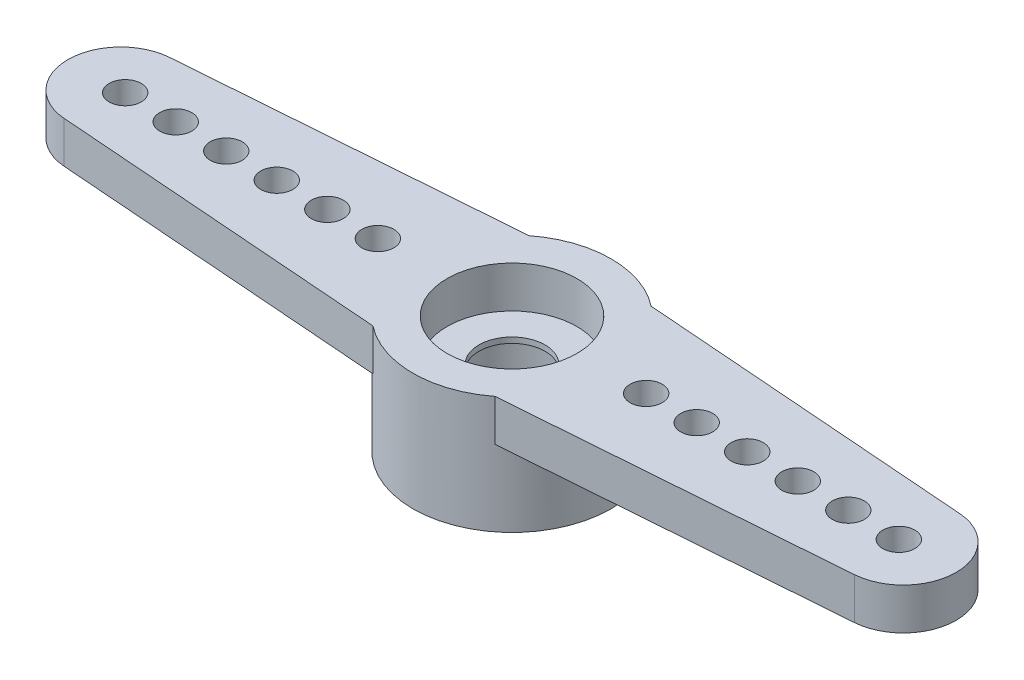
ISO-10303-21;
HEADER;
FILE_DESCRIPTION(('STEP AP214'),'2;1');
FILE_NAME('part.step','',(''),(''),'','','');
FILE_SCHEMA(('AUTOMOTIVE_DESIGN { 1 0 10303 214 1 1 1 1 }'));
ENDSEC;
DATA;
#1=APPLICATION_CONTEXT('core data for automotive mechanical design processes');
#2=APPLICATION_PROTOCOL_DEFINITION('international standard','automotive_design',2000,#1);
#3=PRODUCT_CONTEXT('',#1,'mechanical');
#4=PRODUCT('Part','Part','',(#3));
#5=PRODUCT_RELATED_PRODUCT_CATEGORY('part','',(#4));
#6=PRODUCT_DEFINITION_FORMATION('','',#4);
#7=PRODUCT_DEFINITION_CONTEXT('part definition',#1,'design');
#8=PRODUCT_DEFINITION('design','',#6,#7);
#9=PRODUCT_DEFINITION_SHAPE('','',#8);
#10=(LENGTH_UNIT() NAMED_UNIT(*) SI_UNIT(.MILLI.,.METRE.));
#11=(NAMED_UNIT(*) PLANE_ANGLE_UNIT() SI_UNIT($,.RADIAN.));
#12=(NAMED_UNIT(*) SI_UNIT($,.STERADIAN.) SOLID_ANGLE_UNIT());
#13=UNCERTAINTY_MEASURE_WITH_UNIT(LENGTH_MEASURE(1.E-05),#10,'distance_accuracy_value','');
#14=(GEOMETRIC_REPRESENTATION_CONTEXT(3) GLOBAL_UNCERTAINTY_ASSIGNED_CONTEXT((#13)) GLOBAL_UNIT_ASSIGNED_CONTEXT((#10,
#11,#12)) REPRESENTATION_CONTEXT('',''));
#15=CARTESIAN_POINT('',(0.,0.,0.));
#16=DIRECTION('',(0.,0.,1.));
#17=DIRECTION('',(1.,0.,0.));
#18=AXIS2_PLACEMENT_3D('',#15,#16,#17);
#19=CARTESIAN_POINT('',(-14.13,0.,0.));
#20=DIRECTION('',(0.,1.,0.));
#21=DIRECTION('',(0.,0.,1.));
#22=AXIS2_PLACEMENT_3D('',#19,#20,#21);
#23=PLANE('',#22);
#24=CARTESIAN_POINT('',(12.145,0.,0.));
#25=DIRECTION('',(0.,1.,0.));
#26=DIRECTION('',(0.,0.,1.));
#27=AXIS2_PLACEMENT_3D('',#24,#25,#26);
#28=CIRCLE('',#27,0.58);
#29=CARTESIAN_POINT('',(12.145,0.,0.58));
#30=VERTEX_POINT('',#29);
#31=EDGE_CURVE('E363',#30,#30,#28,.F.);
#32=ORIENTED_EDGE('',*,*,#31,.F.);
#33=EDGE_LOOP('',(#32));
#34=FACE_BOUND('',#33,.T.);
#35=CARTESIAN_POINT('',(8.495,0.,0.));
#36=DIRECTION('',(0.,1.,0.));
#37=DIRECTION('',(0.,0.,1.));
#38=AXIS2_PLACEMENT_3D('',#35,#36,#37);
#39=CIRCLE('',#38,0.58);
#40=CARTESIAN_POINT('',(8.495,0.,0.58));
#41=VERTEX_POINT('',#40);
#42=EDGE_CURVE('E378',#41,#41,#39,.F.);
#43=ORIENTED_EDGE('',*,*,#42,.F.);
#44=EDGE_LOOP('',(#43));
#45=FACE_BOUND('',#44,.T.);
#46=CARTESIAN_POINT('',(4.845,0.,0.));
#47=DIRECTION('',(0.,1.,0.));
#48=DIRECTION('',(0.,0.,1.));
#49=AXIS2_PLACEMENT_3D('',#46,#47,#48);
#50=CIRCLE('',#49,0.58);
#51=CARTESIAN_POINT('',(4.845,0.,0.58));
#52=VERTEX_POINT('',#51);
#53=EDGE_CURVE('E390',#52,#52,#50,.F.);
#54=ORIENTED_EDGE('',*,*,#53,.F.);
#55=EDGE_LOOP('',(#54));
#56=FACE_BOUND('',#55,.T.);
#57=CARTESIAN_POINT('',(0.,0.,0.));
#58=DIRECTION('',(0.,-1.,0.));
#59=DIRECTION('',(0.,0.,-1.));
#60=AXIS2_PLACEMENT_3D('',#57,#58,#59);
#61=CIRCLE('',#60,3.58);
#62=CARTESIAN_POINT('',(2.20544780033444,0.,-2.82));
#63=VERTEX_POINT('',#62);
#64=CARTESIAN_POINT('',(2.20544780033444,0.,2.82));
#65=VERTEX_POINT('',#64);
#66=EDGE_CURVE('E148',#63,#65,#61,.T.);
#67=ORIENTED_EDGE('',*,*,#66,.F.);
#68=DIRECTION('',(-0.997135515892556,0.,-0.0756357253266335));
#69=VECTOR('',#68,1.);
#70=CARTESIAN_POINT('',(14.2744642353739,0.,-1.90452883535478));
#71=LINE('',#70,#69);
#72=CARTESIAN_POINT('',(14.2744642353739,0.,-1.90452883535478));
#73=VERTEX_POINT('',#72);
#74=EDGE_CURVE('E116',#73,#63,#71,.T.);
#75=ORIENTED_EDGE('',*,*,#74,.F.);
#76=CARTESIAN_POINT('',(14.13,0.,0.));
#77=DIRECTION('',(0.,1.,0.));
#78=DIRECTION('',(0.,0.,1.));
#79=AXIS2_PLACEMENT_3D('',#76,#77,#78);
#80=CIRCLE('',#79,1.91);
#81=CARTESIAN_POINT('',(14.2744642353739,0.,1.90452883535478));
#82=VERTEX_POINT('',#81);
#83=EDGE_CURVE('E133',#82,#73,#80,.T.);
#84=ORIENTED_EDGE('',*,*,#83,.F.);
#85=DIRECTION('',(0.997135515892556,0.,-0.0756357253266335));
#86=VECTOR('',#85,1.);
#87=CARTESIAN_POINT('',(14.2744642353739,0.,1.90452883535478));
#88=LINE('',#87,#86);
#89=EDGE_CURVE('E135',#65,#82,#88,.T.);
#90=ORIENTED_EDGE('',*,*,#89,.F.);
#91=EDGE_LOOP('',(#67,#75,#84,#90));
#92=FACE_BOUND('',#91,.T.);
#93=CARTESIAN_POINT('',(6.67,0.,0.));
#94=DIRECTION('',(0.,1.,0.));
#95=DIRECTION('',(0.,0.,1.));
#96=AXIS2_PLACEMENT_3D('',#93,#94,#95);
#97=CIRCLE('',#96,0.58);
#98=CARTESIAN_POINT('',(6.67,0.,0.58));
#99=VERTEX_POINT('',#98);
#100=EDGE_CURVE('E384',#99,#99,#97,.F.);
#101=ORIENTED_EDGE('',*,*,#100,.F.);
#102=EDGE_LOOP('',(#101));
#103=FACE_BOUND('',#102,.T.);
#104=CARTESIAN_POINT('',(10.32,0.,0.));
#105=DIRECTION('',(0.,1.,0.));
#106=DIRECTION('',(0.,0.,1.));
#107=AXIS2_PLACEMENT_3D('',#104,#105,#106);
#108=CIRCLE('',#107,0.58);
#109=CARTESIAN_POINT('',(10.32,0.,0.58));
#110=VERTEX_POINT('',#109);
#111=EDGE_CURVE('E372',#110,#110,#108,.F.);
#112=ORIENTED_EDGE('',*,*,#111,.F.);
#113=EDGE_LOOP('',(#112));
#114=FACE_BOUND('',#113,.T.);
#115=CARTESIAN_POINT('',(13.97,0.,0.));
#116=DIRECTION('',(0.,1.,0.));
#117=DIRECTION('',(0.,0.,1.));
#118=AXIS2_PLACEMENT_3D('',#115,#116,#117);
#119=CIRCLE('',#118,0.58);
#120=CARTESIAN_POINT('',(13.97,0.,0.58));
#121=VERTEX_POINT('',#120);
#122=EDGE_CURVE('E358',#121,#121,#119,.F.);
#123=ORIENTED_EDGE('',*,*,#122,.F.);
#124=EDGE_LOOP('',(#123));
#125=FACE_BOUND('',#124,.T.);
#126=ADVANCED_FACE('F30',(#34,#45,#56,#92,#103,#114,#125),#23,.F.);
#127=CARTESIAN_POINT('',(-14.13,1.5,0.));
#128=DIRECTION('',(0.,1.,0.));
#129=DIRECTION('',(0.,0.,1.));
#130=AXIS2_PLACEMENT_3D('',#127,#128,#129);
#131=PLANE('',#130);
#132=CARTESIAN_POINT('',(12.145,1.5,0.));
#133=DIRECTION('',(0.,-1.,0.));
#134=DIRECTION('',(0.,0.,1.));
#135=AXIS2_PLACEMENT_3D('',#132,#133,#134);
#136=CIRCLE('',#135,0.58);
#137=CARTESIAN_POINT('',(12.145,1.5,0.58));
#138=VERTEX_POINT('',#137);
#139=EDGE_CURVE('E360',#138,#138,#136,.T.);
#140=ORIENTED_EDGE('',*,*,#139,.T.);
#141=EDGE_LOOP('',(#140));
#142=FACE_BOUND('',#141,.T.);
#143=CARTESIAN_POINT('',(8.495,1.5,0.));
#144=DIRECTION('',(0.,-1.,0.));
#145=DIRECTION('',(0.,0.,1.));
#146=AXIS2_PLACEMENT_3D('',#143,#144,#145);
#147=CIRCLE('',#146,0.58);
#148=CARTESIAN_POINT('',(8.495,1.5,0.58));
#149=VERTEX_POINT('',#148);
#150=EDGE_CURVE('E375',#149,#149,#147,.T.);
#151=ORIENTED_EDGE('',*,*,#150,.T.);
#152=EDGE_LOOP('',(#151));
#153=FACE_BOUND('',#152,.T.);
#154=CARTESIAN_POINT('',(4.845,1.5,0.));
#155=DIRECTION('',(0.,-1.,0.));
#156=DIRECTION('',(0.,0.,1.));
#157=AXIS2_PLACEMENT_3D('',#154,#155,#156);
#158=CIRCLE('',#157,0.58);
#159=CARTESIAN_POINT('',(4.845,1.5,0.58));
#160=VERTEX_POINT('',#159);
#161=EDGE_CURVE('E387',#160,#160,#158,.T.);
#162=ORIENTED_EDGE('',*,*,#161,.T.);
#163=EDGE_LOOP('',(#162));
#164=FACE_BOUND('',#163,.T.);
#165=CARTESIAN_POINT('',(-13.97,1.5,0.));
#166=DIRECTION('',(0.,1.,0.));
#167=DIRECTION('',(0.,0.,1.));
#168=AXIS2_PLACEMENT_3D('',#165,#166,#167);
#169=CIRCLE('',#168,0.58);
#170=CARTESIAN_POINT('',(-13.97,1.5,0.58));
#171=VERTEX_POINT('',#170);
#172=EDGE_CURVE('E393',#171,#171,#169,.T.);
#173=ORIENTED_EDGE('',*,*,#172,.F.);
#174=EDGE_LOOP('',(#173));
#175=FACE_BOUND('',#174,.T.);
#176=CARTESIAN_POINT('',(-12.145,1.5,0.));
#177=DIRECTION('',(0.,1.,0.));
#178=DIRECTION('',(0.,0.,1.));
#179=AXIS2_PLACEMENT_3D('',#176,#177,#178);
#180=CIRCLE('',#179,0.58);
#181=CARTESIAN_POINT('',(-12.145,1.5,0.58));
#182=VERTEX_POINT('',#181);
#183=EDGE_CURVE('E397',#182,#182,#180,.T.);
#184=ORIENTED_EDGE('',*,*,#183,.F.);
#185=EDGE_LOOP('',(#184));
#186=FACE_BOUND('',#185,.T.);
#187=CARTESIAN_POINT('',(-10.32,1.5,0.));
#188=DIRECTION('',(0.,1.,0.));
#189=DIRECTION('',(0.,0.,1.));
#190=AXIS2_PLACEMENT_3D('',#187,#188,#189);
#191=CIRCLE('',#190,0.58);
#192=CARTESIAN_POINT('',(-10.32,1.5,0.58));
#193=VERTEX_POINT('',#192);
#194=EDGE_CURVE('E401',#193,#193,#191,.T.);
#195=ORIENTED_EDGE('',*,*,#194,.F.);
#196=EDGE_LOOP('',(#195));
#197=FACE_BOUND('',#196,.T.);
#198=CARTESIAN_POINT('',(-8.495,1.5,0.));
#199=DIRECTION('',(0.,1.,0.));
#200=DIRECTION('',(0.,0.,1.));
#201=AXIS2_PLACEMENT_3D('',#198,#199,#200);
#202=CIRCLE('',#201,0.58);
#203=CARTESIAN_POINT('',(-8.495,1.5,0.58));
#204=VERTEX_POINT('',#203);
#205=EDGE_CURVE('E405',#204,#204,#202,.T.);
#206=ORIENTED_EDGE('',*,*,#205,.F.);
#207=EDGE_LOOP('',(#206));
#208=FACE_BOUND('',#207,.T.);
#209=CARTESIAN_POINT('',(-6.67,1.5,0.));
#210=DIRECTION('',(0.,1.,0.));
#211=DIRECTION('',(0.,0.,1.));
#212=AXIS2_PLACEMENT_3D('',#209,#210,#211);
#213=CIRCLE('',#212,0.58);
#214=CARTESIAN_POINT('',(-6.67,1.5,0.58));
#215=VERTEX_POINT('',#214);
#216=EDGE_CURVE('E409',#215,#215,#213,.T.);
#217=ORIENTED_EDGE('',*,*,#216,.F.);
#218=EDGE_LOOP('',(#217));
#219=FACE_BOUND('',#218,.T.);
#220=CARTESIAN_POINT('',(-4.845,1.5,0.));
#221=DIRECTION('',(0.,1.,0.));
#222=DIRECTION('',(0.,0.,1.));
#223=AXIS2_PLACEMENT_3D('',#220,#221,#222);
#224=CIRCLE('',#223,0.58);
#225=CARTESIAN_POINT('',(-4.845,1.5,0.58));
#226=VERTEX_POINT('',#225);
#227=EDGE_CURVE('E265',#226,#226,#224,.T.);
#228=ORIENTED_EDGE('',*,*,#227,.F.);
#229=EDGE_LOOP('',(#228));
#230=FACE_BOUND('',#229,.T.);
#231=CARTESIAN_POINT('',(-14.13,1.5,0.));
#232=DIRECTION('',(0.,1.,0.));
#233=DIRECTION('',(0.,0.,1.));
#234=AXIS2_PLACEMENT_3D('',#231,#232,#233);
#235=CIRCLE('',#234,1.91);
#236=CARTESIAN_POINT('',(-14.2744642353739,1.5,-1.90452883535478));
#237=VERTEX_POINT('',#236);
#238=CARTESIAN_POINT('',(-14.2744642353739,1.5,1.90452883535478));
#239=VERTEX_POINT('',#238);
#240=EDGE_CURVE('E159',#237,#239,#235,.T.);
#241=ORIENTED_EDGE('',*,*,#240,.T.);
#242=DIRECTION('',(0.997135515892556,0.,0.0756357253266335));
#243=VECTOR('',#242,1.);
#244=CARTESIAN_POINT('',(-14.2744642353739,1.5,1.90452883535478));
#245=LINE('',#244,#243);
#246=CARTESIAN_POINT('',(-2.20544780033444,1.5,2.82));
#247=VERTEX_POINT('',#246);
#248=EDGE_CURVE('E83',#239,#247,#245,.T.);
#249=ORIENTED_EDGE('',*,*,#248,.T.);
#250=CARTESIAN_POINT('',(0.,1.5,0.));
#251=DIRECTION('',(0.,1.,0.));
#252=DIRECTION('',(0.,0.,1.));
#253=AXIS2_PLACEMENT_3D('',#250,#251,#252);
#254=CIRCLE('',#253,3.58);
#255=CARTESIAN_POINT('',(2.20544780033444,1.5,2.82));
#256=VERTEX_POINT('',#255);
#257=EDGE_CURVE('E162',#247,#256,#254,.T.);
#258=ORIENTED_EDGE('',*,*,#257,.T.);
#259=DIRECTION('',(0.997135515892556,0.,-0.0756357253266335));
#260=VECTOR('',#259,1.);
#261=CARTESIAN_POINT('',(14.2744642353739,1.5,1.90452883535478));
#262=LINE('',#261,#260);
#263=CARTESIAN_POINT('',(14.2744642353739,1.5,1.90452883535478));
#264=VERTEX_POINT('',#263);
#265=EDGE_CURVE('E164',#256,#264,#262,.T.);
#266=ORIENTED_EDGE('',*,*,#265,.T.);
#267=CARTESIAN_POINT('',(14.13,1.5,0.));
#268=DIRECTION('',(0.,1.,0.));
#269=DIRECTION('',(0.,0.,1.));
#270=AXIS2_PLACEMENT_3D('',#267,#268,#269);
#271=CIRCLE('',#270,1.91);
#272=CARTESIAN_POINT('',(14.2744642353739,1.5,-1.90452883535478));
#273=VERTEX_POINT('',#272);
#274=EDGE_CURVE('E105',#264,#273,#271,.T.);
#275=ORIENTED_EDGE('',*,*,#274,.T.);
#276=DIRECTION('',(-0.997135515892556,0.,-0.0756357253266335));
#277=VECTOR('',#276,1.);
#278=CARTESIAN_POINT('',(14.2744642353739,1.5,-1.90452883535478));
#279=LINE('',#278,#277);
#280=CARTESIAN_POINT('',(2.20544780033444,1.5,-2.82));
#281=VERTEX_POINT('',#280);
#282=EDGE_CURVE('E98',#273,#281,#279,.T.);
#283=ORIENTED_EDGE('',*,*,#282,.T.);
#284=CARTESIAN_POINT('',(0.,1.5,0.));
#285=DIRECTION('',(0.,1.,0.));
#286=DIRECTION('',(0.,0.,1.));
#287=AXIS2_PLACEMENT_3D('',#284,#285,#286);
#288=CIRCLE('',#287,3.58);
#289=CARTESIAN_POINT('',(-2.20544780033444,1.5,-2.82));
#290=VERTEX_POINT('',#289);
#291=EDGE_CURVE('E103',#281,#290,#288,.T.);
#292=ORIENTED_EDGE('',*,*,#291,.T.);
#293=DIRECTION('',(-0.997135515892556,0.,0.0756357253266335));
#294=VECTOR('',#293,1.);
#295=CARTESIAN_POINT('',(-14.2744642353739,1.5,-1.90452883535478));
#296=LINE('',#295,#294);
#297=EDGE_CURVE('E49',#290,#237,#296,.T.);
#298=ORIENTED_EDGE('',*,*,#297,.T.);
#299=EDGE_LOOP('',(#241,#249,#258,#266,#275,#283,#292,#298));
#300=FACE_BOUND('',#299,.T.);
#301=CARTESIAN_POINT('',(0.,1.5,0.));
#302=DIRECTION('',(0.,1.,0.));
#303=DIRECTION('',(0.,0.,1.));
#304=AXIS2_PLACEMENT_3D('',#301,#302,#303);
#305=CIRCLE('',#304,2.345);
#306=CARTESIAN_POINT('',(0.,1.5,2.345));
#307=VERTEX_POINT('',#306);
#308=EDGE_CURVE('E132',#307,#307,#305,.T.);
#309=ORIENTED_EDGE('',*,*,#308,.F.);
#310=EDGE_LOOP('',(#309));
#311=FACE_BOUND('',#310,.T.);
#312=CARTESIAN_POINT('',(6.67,1.5,0.));
#313=DIRECTION('',(0.,-1.,0.));
#314=DIRECTION('',(0.,0.,1.));
#315=AXIS2_PLACEMENT_3D('',#312,#313,#314);
#316=CIRCLE('',#315,0.58);
#317=CARTESIAN_POINT('',(6.67,1.5,0.58));
#318=VERTEX_POINT('',#317);
#319=EDGE_CURVE('E381',#318,#318,#316,.T.);
#320=ORIENTED_EDGE('',*,*,#319,.T.);
#321=EDGE_LOOP('',(#320));
#322=FACE_BOUND('',#321,.T.);
#323=CARTESIAN_POINT('',(10.32,1.5,0.));
#324=DIRECTION('',(0.,-1.,0.));
#325=DIRECTION('',(0.,0.,1.));
#326=AXIS2_PLACEMENT_3D('',#323,#324,#325);
#327=CIRCLE('',#326,0.58);
#328=CARTESIAN_POINT('',(10.32,1.5,0.58));
#329=VERTEX_POINT('',#328);
#330=EDGE_CURVE('E369',#329,#329,#327,.T.);
#331=ORIENTED_EDGE('',*,*,#330,.T.);
#332=EDGE_LOOP('',(#331));
#333=FACE_BOUND('',#332,.T.);
#334=CARTESIAN_POINT('',(13.97,1.5,0.));
#335=DIRECTION('',(0.,-1.,0.));
#336=DIRECTION('',(0.,0.,1.));
#337=AXIS2_PLACEMENT_3D('',#334,#335,#336);
#338=CIRCLE('',#337,0.58);
#339=CARTESIAN_POINT('',(13.97,1.5,0.58));
#340=VERTEX_POINT('',#339);
#341=EDGE_CURVE('E355',#340,#340,#338,.T.);
#342=ORIENTED_EDGE('',*,*,#341,.T.);
#343=EDGE_LOOP('',(#342));
#344=FACE_BOUND('',#343,.T.);
#345=ADVANCED_FACE('F100',(#142,#153,#164,#175,#186,#197,#208,#219,#230,#300,#311,#322,#333,
#344),#131,.T.);
#346=CARTESIAN_POINT('',(0.,-2.74,0.));
#347=DIRECTION('',(0.,1.,0.));
#348=DIRECTION('',(0.,0.,1.));
#349=AXIS2_PLACEMENT_3D('',#346,#347,#348);
#350=CYLINDRICAL_SURFACE('',#349,2.18);
#351=CARTESIAN_POINT('',(0.,-2.74,0.));
#352=DIRECTION('',(0.,-1.,0.));
#353=DIRECTION('',(0.,0.,-1.));
#354=AXIS2_PLACEMENT_3D('',#351,#352,#353);
#355=CIRCLE('',#354,2.18);
#356=CARTESIAN_POINT('',(0.,-2.74,-2.18));
#357=VERTEX_POINT('',#356);
#358=EDGE_CURVE('E152',#357,#357,#355,.T.);
#359=ORIENTED_EDGE('',*,*,#358,.T.);
#360=EDGE_LOOP('',(#359));
#361=FACE_BOUND('',#360,.T.);
#362=CARTESIAN_POINT('',(0.,-0.2,0.));
#363=DIRECTION('',(0.,1.,0.));
#364=DIRECTION('',(0.,0.,1.));
#365=AXIS2_PLACEMENT_3D('',#362,#363,#364);
#366=CIRCLE('',#365,2.18);
#367=CARTESIAN_POINT('',(0.,-0.2,2.18));
#368=VERTEX_POINT('',#367);
#369=EDGE_CURVE('E34',#368,#368,#366,.T.);
#370=ORIENTED_EDGE('',*,*,#369,.T.);
#371=EDGE_LOOP('',(#370));
#372=FACE_BOUND('',#371,.T.);
#373=ADVANCED_FACE('F227',(#361,#372),#350,.F.);
#374=CARTESIAN_POINT('',(-13.97,0.,0.));
#375=DIRECTION('',(0.,1.,0.));
#376=DIRECTION('',(0.,0.,1.));
#377=AXIS2_PLACEMENT_3D('',#374,#375,#376);
#378=CIRCLE('',#377,0.58);
#379=CARTESIAN_POINT('',(-13.97,0.,0.58));
#380=VERTEX_POINT('',#379);
#381=EDGE_CURVE('E243',#380,#380,#378,.T.);
#382=ORIENTED_EDGE('',*,*,#381,.T.);
#383=EDGE_LOOP('',(#382));
#384=FACE_BOUND('',#383,.T.);
#385=CARTESIAN_POINT('',(-12.145,0.,0.));
#386=DIRECTION('',(0.,1.,0.));
#387=DIRECTION('',(0.,0.,1.));
#388=AXIS2_PLACEMENT_3D('',#385,#386,#387);
#389=CIRCLE('',#388,0.58);
#390=CARTESIAN_POINT('',(-12.145,0.,0.58));
#391=VERTEX_POINT('',#390);
#392=EDGE_CURVE('E247',#391,#391,#389,.T.);
#393=ORIENTED_EDGE('',*,*,#392,.T.);
#394=EDGE_LOOP('',(#393));
#395=FACE_BOUND('',#394,.T.);
#396=CARTESIAN_POINT('',(-10.32,0.,0.));
#397=DIRECTION('',(0.,1.,0.));
#398=DIRECTION('',(0.,0.,1.));
#399=AXIS2_PLACEMENT_3D('',#396,#397,#398);
#400=CIRCLE('',#399,0.58);
#401=CARTESIAN_POINT('',(-10.32,0.,0.58));
#402=VERTEX_POINT('',#401);
#403=EDGE_CURVE('E251',#402,#402,#400,.T.);
#404=ORIENTED_EDGE('',*,*,#403,.T.);
#405=EDGE_LOOP('',(#404));
#406=FACE_BOUND('',#405,.T.);
#407=CARTESIAN_POINT('',(-8.495,0.,0.));
#408=DIRECTION('',(0.,1.,0.));
#409=DIRECTION('',(0.,0.,1.));
#410=AXIS2_PLACEMENT_3D('',#407,#408,#409);
#411=CIRCLE('',#410,0.58);
#412=CARTESIAN_POINT('',(-8.495,0.,0.58));
#413=VERTEX_POINT('',#412);
#414=EDGE_CURVE('E255',#413,#413,#411,.T.);
#415=ORIENTED_EDGE('',*,*,#414,.T.);
#416=EDGE_LOOP('',(#415));
#417=FACE_BOUND('',#416,.T.);
#418=CARTESIAN_POINT('',(-6.67,0.,0.));
#419=DIRECTION('',(0.,1.,0.));
#420=DIRECTION('',(0.,0.,1.));
#421=AXIS2_PLACEMENT_3D('',#418,#419,#420);
#422=CIRCLE('',#421,0.58);
#423=CARTESIAN_POINT('',(-6.67,0.,0.58));
#424=VERTEX_POINT('',#423);
#425=EDGE_CURVE('E259',#424,#424,#422,.T.);
#426=ORIENTED_EDGE('',*,*,#425,.T.);
#427=EDGE_LOOP('',(#426));
#428=FACE_BOUND('',#427,.T.);
#429=CARTESIAN_POINT('',(-4.845,0.,0.));
#430=DIRECTION('',(0.,1.,0.));
#431=DIRECTION('',(0.,0.,1.));
#432=AXIS2_PLACEMENT_3D('',#429,#430,#431);
#433=CIRCLE('',#432,0.58);
#434=CARTESIAN_POINT('',(-4.845,0.,0.58));
#435=VERTEX_POINT('',#434);
#436=EDGE_CURVE('E262',#435,#435,#433,.T.);
#437=ORIENTED_EDGE('',*,*,#436,.T.);
#438=EDGE_LOOP('',(#437));
#439=FACE_BOUND('',#438,.T.);
#440=CARTESIAN_POINT('',(-2.20544780033444,0.,2.82));
#441=VERTEX_POINT('',#440);
#442=CARTESIAN_POINT('',(-2.20544780033444,0.,-2.82));
#443=VERTEX_POINT('',#442);
#444=EDGE_CURVE('E11',#441,#443,#61,.T.);
#445=ORIENTED_EDGE('',*,*,#444,.F.);
#446=DIRECTION('',(0.997135515892556,0.,0.0756357253266335));
#447=VECTOR('',#446,1.);
#448=CARTESIAN_POINT('',(-14.2744642353739,0.,1.90452883535478));
#449=LINE('',#448,#447);
#450=CARTESIAN_POINT('',(-14.2744642353739,0.,1.90452883535478));
#451=VERTEX_POINT('',#450);
#452=EDGE_CURVE('E131',#451,#441,#449,.T.);
#453=ORIENTED_EDGE('',*,*,#452,.F.);
#454=CARTESIAN_POINT('',(-14.13,0.,0.));
#455=DIRECTION('',(0.,1.,0.));
#456=DIRECTION('',(0.,0.,1.));
#457=AXIS2_PLACEMENT_3D('',#454,#455,#456);
#458=CIRCLE('',#457,1.91);
#459=CARTESIAN_POINT('',(-14.2744642353739,0.,-1.90452883535478));
#460=VERTEX_POINT('',#459);
#461=EDGE_CURVE('E128',#460,#451,#458,.T.);
#462=ORIENTED_EDGE('',*,*,#461,.F.);
#463=DIRECTION('',(-0.997135515892556,0.,0.0756357253266335));
#464=VECTOR('',#463,1.);
#465=CARTESIAN_POINT('',(-14.2744642353739,0.,-1.90452883535478));
#466=LINE('',#465,#464);
#467=EDGE_CURVE('E74',#443,#460,#466,.T.);
#468=ORIENTED_EDGE('',*,*,#467,.F.);
#469=EDGE_LOOP('',(#445,#453,#462,#468));
#470=FACE_BOUND('',#469,.T.);
#471=ADVANCED_FACE('F204',(#384,#395,#406,#417,#428,#439,#470),#23,.F.);
#472=CARTESIAN_POINT('',(-14.13,1.5,0.));
#473=DIRECTION('',(0.,-1.,0.));
#474=DIRECTION('',(0.,0.,-1.));
#475=AXIS2_PLACEMENT_3D('',#472,#473,#474);
#476=CYLINDRICAL_SURFACE('',#475,1.91);
#477=ORIENTED_EDGE('',*,*,#461,.T.);
#478=DIRECTION('',(0.,-1.,0.));
#479=VECTOR('',#478,1.);
#480=CARTESIAN_POINT('',(-14.2744642353739,1.5,1.90452883535478));
#481=LINE('',#480,#479);
#482=EDGE_CURVE('E40',#239,#451,#481,.T.);
#483=ORIENTED_EDGE('',*,*,#482,.F.);
#484=ORIENTED_EDGE('',*,*,#240,.F.);
#485=DIRECTION('',(0.,-1.,0.));
#486=VECTOR('',#485,1.);
#487=CARTESIAN_POINT('',(-14.2744642353739,1.5,-1.90452883535478));
#488=LINE('',#487,#486);
#489=EDGE_CURVE('E124',#237,#460,#488,.T.);
#490=ORIENTED_EDGE('',*,*,#489,.T.);
#491=EDGE_LOOP('',(#477,#483,#484,#490));
#492=FACE_BOUND('',#491,.T.);
#493=ADVANCED_FACE('F32',(#492),#476,.T.);
#494=CARTESIAN_POINT('',(-14.2744642353739,1.5,1.90452883535478));
#495=DIRECTION('',(0.0756357253266335,0.,-0.997135515892556));
#496=DIRECTION('',(-0.997135515892556,0.,-0.0756357253266336));
#497=AXIS2_PLACEMENT_3D('',#494,#495,#496);
#498=PLANE('',#497);
#499=ORIENTED_EDGE('',*,*,#452,.T.);
#500=DIRECTION('',(0.,-1.,0.));
#501=VECTOR('',#500,1.);
#502=CARTESIAN_POINT('',(-2.20544780033444,1.5,2.82));
#503=LINE('',#502,#501);
#504=EDGE_CURVE('E143',#247,#441,#503,.T.);
#505=ORIENTED_EDGE('',*,*,#504,.F.);
#506=ORIENTED_EDGE('',*,*,#248,.F.);
#507=ORIENTED_EDGE('',*,*,#482,.T.);
#508=EDGE_LOOP('',(#499,#505,#506,#507));
#509=FACE_BOUND('',#508,.T.);
#510=ADVANCED_FACE('F200',(#509),#498,.F.);
#511=CARTESIAN_POINT('',(14.2744642353739,1.5,1.90452883535478));
#512=DIRECTION('',(-0.0756357253266335,0.,-0.997135515892556));
#513=DIRECTION('',(-0.997135515892556,0.,0.0756357253266336));
#514=AXIS2_PLACEMENT_3D('',#511,#512,#513);
#515=PLANE('',#514);
#516=ORIENTED_EDGE('',*,*,#89,.T.);
#517=DIRECTION('',(0.,-1.,0.));
#518=VECTOR('',#517,1.);
#519=CARTESIAN_POINT('',(14.2744642353739,1.5,1.90452883535478));
#520=LINE('',#519,#518);
#521=EDGE_CURVE('E138',#264,#82,#520,.T.);
#522=ORIENTED_EDGE('',*,*,#521,.F.);
#523=ORIENTED_EDGE('',*,*,#265,.F.);
#524=DIRECTION('',(0.,-1.,0.));
#525=VECTOR('',#524,1.);
#526=CARTESIAN_POINT('',(2.20544780033444,1.5,2.82));
#527=LINE('',#526,#525);
#528=EDGE_CURVE('E141',#256,#65,#527,.T.);
#529=ORIENTED_EDGE('',*,*,#528,.T.);
#530=EDGE_LOOP('',(#516,#522,#523,#529));
#531=FACE_BOUND('',#530,.T.);
#532=ADVANCED_FACE('F171',(#531),#515,.F.);
#533=CARTESIAN_POINT('',(14.13,1.5,0.));
#534=DIRECTION('',(0.,-1.,0.));
#535=DIRECTION('',(0.,0.,-1.));
#536=AXIS2_PLACEMENT_3D('',#533,#534,#535);
#537=CYLINDRICAL_SURFACE('',#536,1.91);
#538=ORIENTED_EDGE('',*,*,#83,.T.);
#539=DIRECTION('',(0.,-1.,0.));
#540=VECTOR('',#539,1.);
#541=CARTESIAN_POINT('',(14.2744642353739,1.5,-1.90452883535478));
#542=LINE('',#541,#540);
#543=EDGE_CURVE('E118',#273,#73,#542,.T.);
#544=ORIENTED_EDGE('',*,*,#543,.F.);
#545=ORIENTED_EDGE('',*,*,#274,.F.);
#546=ORIENTED_EDGE('',*,*,#521,.T.);
#547=EDGE_LOOP('',(#538,#544,#545,#546));
#548=FACE_BOUND('',#547,.T.);
#549=ADVANCED_FACE('F175',(#548),#537,.T.);
#550=CARTESIAN_POINT('',(14.2744642353739,1.5,-1.90452883535478));
#551=DIRECTION('',(-0.0756357253266335,0.,0.997135515892556));
#552=DIRECTION('',(0.997135515892556,0.,0.0756357253266335));
#553=AXIS2_PLACEMENT_3D('',#550,#551,#552);
#554=PLANE('',#553);
#555=ORIENTED_EDGE('',*,*,#74,.T.);
#556=DIRECTION('',(0.,-1.,0.));
#557=VECTOR('',#556,1.);
#558=CARTESIAN_POINT('',(2.20544780033444,1.5,-2.82));
#559=LINE('',#558,#557);
#560=EDGE_CURVE('E112',#281,#63,#559,.T.);
#561=ORIENTED_EDGE('',*,*,#560,.F.);
#562=ORIENTED_EDGE('',*,*,#282,.F.);
#563=ORIENTED_EDGE('',*,*,#543,.T.);
#564=EDGE_LOOP('',(#555,#561,#562,#563));
#565=FACE_BOUND('',#564,.T.);
#566=ADVANCED_FACE('F113',(#565),#554,.F.);
#567=CARTESIAN_POINT('',(0.,1.5,0.));
#568=DIRECTION('',(0.,-1.,0.));
#569=DIRECTION('',(0.,0.,-1.));
#570=AXIS2_PLACEMENT_3D('',#567,#568,#569);
#571=CYLINDRICAL_SURFACE('',#570,3.58);
#572=ORIENTED_EDGE('',*,*,#560,.T.);
#573=ORIENTED_EDGE('',*,*,#66,.T.);
#574=ORIENTED_EDGE('',*,*,#528,.F.);
#575=ORIENTED_EDGE('',*,*,#257,.F.);
#576=ORIENTED_EDGE('',*,*,#504,.T.);
#577=ORIENTED_EDGE('',*,*,#444,.T.);
#578=DIRECTION('',(0.,-1.,0.));
#579=VECTOR('',#578,1.);
#580=CARTESIAN_POINT('',(-2.20544780033444,1.5,-2.82));
#581=LINE('',#580,#579);
#582=EDGE_CURVE('E119',#290,#443,#581,.T.);
#583=ORIENTED_EDGE('',*,*,#582,.F.);
#584=ORIENTED_EDGE('',*,*,#291,.F.);
#585=EDGE_LOOP('',(#572,#573,#574,#575,#576,#577,#583,#584));
#586=FACE_BOUND('',#585,.T.);
#587=CARTESIAN_POINT('',(0.,-2.74,0.));
#588=DIRECTION('',(0.,-1.,0.));
#589=DIRECTION('',(0.,0.,-1.));
#590=AXIS2_PLACEMENT_3D('',#587,#588,#589);
#591=CIRCLE('',#590,3.58);
#592=CARTESIAN_POINT('',(0.,-2.74,-3.58));
#593=VERTEX_POINT('',#592);
#594=EDGE_CURVE('E151',#593,#593,#591,.T.);
#595=ORIENTED_EDGE('',*,*,#594,.F.);
#596=EDGE_LOOP('',(#595));
#597=FACE_BOUND('',#596,.T.);
#598=ADVANCED_FACE('F121',(#586,#597),#571,.T.);
#599=CARTESIAN_POINT('',(-14.2744642353739,1.5,-1.90452883535478));
#600=DIRECTION('',(0.0756357253266335,0.,0.997135515892556));
#601=DIRECTION('',(0.997135515892556,0.,-0.0756357253266336));
#602=AXIS2_PLACEMENT_3D('',#599,#600,#601);
#603=PLANE('',#602);
#604=ORIENTED_EDGE('',*,*,#467,.T.);
#605=ORIENTED_EDGE('',*,*,#489,.F.);
#606=ORIENTED_EDGE('',*,*,#297,.F.);
#607=ORIENTED_EDGE('',*,*,#582,.T.);
#608=EDGE_LOOP('',(#604,#605,#606,#607));
#609=FACE_BOUND('',#608,.T.);
#610=ADVANCED_FACE('F207',(#609),#603,.F.);
#611=CARTESIAN_POINT('',(0.,1.5,0.));
#612=DIRECTION('',(0.,-1.,0.));
#613=DIRECTION('',(0.,0.,-1.));
#614=AXIS2_PLACEMENT_3D('',#611,#612,#613);
#615=CYLINDRICAL_SURFACE('',#614,2.345);
#616=ORIENTED_EDGE('',*,*,#308,.T.);
#617=EDGE_LOOP('',(#616));
#618=FACE_BOUND('',#617,.T.);
#619=CARTESIAN_POINT('',(0.,0.,0.));
#620=DIRECTION('',(0.,1.,0.));
#621=DIRECTION('',(0.,0.,1.));
#622=AXIS2_PLACEMENT_3D('',#619,#620,#621);
#623=CIRCLE('',#622,2.345);
#624=CARTESIAN_POINT('',(0.,0.,2.345));
#625=VERTEX_POINT('',#624);
#626=EDGE_CURVE('E156',#625,#625,#623,.T.);
#627=ORIENTED_EDGE('',*,*,#626,.F.);
#628=EDGE_LOOP('',(#627));
#629=FACE_BOUND('',#628,.T.);
#630=ADVANCED_FACE('F211',(#618,#629),#615,.F.);
#631=CARTESIAN_POINT('',(0.,0.,0.));
#632=DIRECTION('',(0.,-1.,0.));
#633=DIRECTION('',(0.,0.,-1.));
#634=AXIS2_PLACEMENT_3D('',#631,#632,#633);
#635=PLANE('',#634);
#636=ORIENTED_EDGE('',*,*,#626,.T.);
#637=EDGE_LOOP('',(#636));
#638=FACE_BOUND('',#637,.T.);
#639=CARTESIAN_POINT('',(0.,0.,0.));
#640=DIRECTION('',(0.,1.,0.));
#641=DIRECTION('',(0.,0.,1.));
#642=AXIS2_PLACEMENT_3D('',#639,#640,#641);
#643=CIRCLE('',#642,1.195);
#644=CARTESIAN_POINT('',(0.,0.,1.195));
#645=VERTEX_POINT('',#644);
#646=EDGE_CURVE('E264',#645,#645,#643,.T.);
#647=ORIENTED_EDGE('',*,*,#646,.F.);
#648=EDGE_LOOP('',(#647));
#649=FACE_BOUND('',#648,.T.);
#650=ADVANCED_FACE('F217',(#638,#649),#635,.F.);
#651=CARTESIAN_POINT('',(0.,-2.74,0.));
#652=DIRECTION('',(0.,-1.,0.));
#653=DIRECTION('',(0.,0.,-1.));
#654=AXIS2_PLACEMENT_3D('',#651,#652,#653);
#655=PLANE('',#654);
#656=ORIENTED_EDGE('',*,*,#594,.T.);
#657=EDGE_LOOP('',(#656));
#658=FACE_BOUND('',#657,.T.);
#659=ORIENTED_EDGE('',*,*,#358,.F.);
#660=EDGE_LOOP('',(#659));
#661=FACE_BOUND('',#660,.T.);
#662=ADVANCED_FACE('F285',(#658,#661),#655,.T.);
#663=CARTESIAN_POINT('',(0.,-0.2,0.));
#664=DIRECTION('',(0.,1.,0.));
#665=DIRECTION('',(0.,0.,1.));
#666=AXIS2_PLACEMENT_3D('',#663,#664,#665);
#667=PLANE('',#666);
#668=ORIENTED_EDGE('',*,*,#369,.F.);
#669=EDGE_LOOP('',(#668));
#670=FACE_BOUND('',#669,.T.);
#671=CARTESIAN_POINT('',(0.,-0.2,0.));
#672=DIRECTION('',(0.,1.,0.));
#673=DIRECTION('',(0.,0.,1.));
#674=AXIS2_PLACEMENT_3D('',#671,#672,#673);
#675=CIRCLE('',#674,1.195);
#676=CARTESIAN_POINT('',(0.,-0.2,1.195));
#677=VERTEX_POINT('',#676);
#678=EDGE_CURVE('E268',#677,#677,#675,.T.);
#679=ORIENTED_EDGE('',*,*,#678,.T.);
#680=EDGE_LOOP('',(#679));
#681=FACE_BOUND('',#680,.T.);
#682=ADVANCED_FACE('F281',(#670,#681),#667,.F.);
#683=CARTESIAN_POINT('',(0.,-0.2,0.));
#684=DIRECTION('',(0.,1.,0.));
#685=DIRECTION('',(0.,0.,1.));
#686=AXIS2_PLACEMENT_3D('',#683,#684,#685);
#687=CYLINDRICAL_SURFACE('',#686,1.195);
#688=ORIENTED_EDGE('',*,*,#678,.F.);
#689=EDGE_LOOP('',(#688));
#690=FACE_BOUND('',#689,.T.);
#691=ORIENTED_EDGE('',*,*,#646,.T.);
#692=EDGE_LOOP('',(#691));
#693=FACE_BOUND('',#692,.T.);
#694=ADVANCED_FACE('F284',(#690,#693),#687,.F.);
#695=CARTESIAN_POINT('',(-4.845,-2.74,0.));
#696=DIRECTION('',(0.,1.,0.));
#697=DIRECTION('',(0.,0.,1.));
#698=AXIS2_PLACEMENT_3D('',#695,#696,#697);
#699=CYLINDRICAL_SURFACE('',#698,0.58);
#700=ORIENTED_EDGE('',*,*,#227,.T.);
#701=EDGE_LOOP('',(#700));
#702=FACE_BOUND('',#701,.T.);
#703=ORIENTED_EDGE('',*,*,#436,.F.);
#704=EDGE_LOOP('',(#703));
#705=FACE_BOUND('',#704,.T.);
#706=ADVANCED_FACE('F291',(#702,#705),#699,.F.);
#707=CARTESIAN_POINT('',(-6.67,-2.74,0.));
#708=DIRECTION('',(0.,1.,0.));
#709=DIRECTION('',(0.,0.,1.));
#710=AXIS2_PLACEMENT_3D('',#707,#708,#709);
#711=CYLINDRICAL_SURFACE('',#710,0.58);
#712=ORIENTED_EDGE('',*,*,#216,.T.);
#713=EDGE_LOOP('',(#712));
#714=FACE_BOUND('',#713,.T.);
#715=ORIENTED_EDGE('',*,*,#425,.F.);
#716=EDGE_LOOP('',(#715));
#717=FACE_BOUND('',#716,.T.);
#718=ADVANCED_FACE('F306',(#714,#717),#711,.F.);
#719=CARTESIAN_POINT('',(-8.495,-2.74,0.));
#720=DIRECTION('',(0.,1.,0.));
#721=DIRECTION('',(0.,0.,1.));
#722=AXIS2_PLACEMENT_3D('',#719,#720,#721);
#723=CYLINDRICAL_SURFACE('',#722,0.58);
#724=ORIENTED_EDGE('',*,*,#205,.T.);
#725=EDGE_LOOP('',(#724));
#726=FACE_BOUND('',#725,.T.);
#727=ORIENTED_EDGE('',*,*,#414,.F.);
#728=EDGE_LOOP('',(#727));
#729=FACE_BOUND('',#728,.T.);
#730=ADVANCED_FACE('F310',(#726,#729),#723,.F.);
#731=CARTESIAN_POINT('',(-10.32,-2.74,0.));
#732=DIRECTION('',(0.,1.,0.));
#733=DIRECTION('',(0.,0.,1.));
#734=AXIS2_PLACEMENT_3D('',#731,#732,#733);
#735=CYLINDRICAL_SURFACE('',#734,0.58);
#736=ORIENTED_EDGE('',*,*,#194,.T.);
#737=EDGE_LOOP('',(#736));
#738=FACE_BOUND('',#737,.T.);
#739=ORIENTED_EDGE('',*,*,#403,.F.);
#740=EDGE_LOOP('',(#739));
#741=FACE_BOUND('',#740,.T.);
#742=ADVANCED_FACE('F314',(#738,#741),#735,.F.);
#743=CARTESIAN_POINT('',(-12.145,-2.74,0.));
#744=DIRECTION('',(0.,1.,0.));
#745=DIRECTION('',(0.,0.,1.));
#746=AXIS2_PLACEMENT_3D('',#743,#744,#745);
#747=CYLINDRICAL_SURFACE('',#746,0.58);
#748=ORIENTED_EDGE('',*,*,#183,.T.);
#749=EDGE_LOOP('',(#748));
#750=FACE_BOUND('',#749,.T.);
#751=ORIENTED_EDGE('',*,*,#392,.F.);
#752=EDGE_LOOP('',(#751));
#753=FACE_BOUND('',#752,.T.);
#754=ADVANCED_FACE('F318',(#750,#753),#747,.F.);
#755=CARTESIAN_POINT('',(-13.97,-2.74,0.));
#756=DIRECTION('',(0.,1.,0.));
#757=DIRECTION('',(0.,0.,1.));
#758=AXIS2_PLACEMENT_3D('',#755,#756,#757);
#759=CYLINDRICAL_SURFACE('',#758,0.58);
#760=ORIENTED_EDGE('',*,*,#172,.T.);
#761=EDGE_LOOP('',(#760));
#762=FACE_BOUND('',#761,.T.);
#763=ORIENTED_EDGE('',*,*,#381,.F.);
#764=EDGE_LOOP('',(#763));
#765=FACE_BOUND('',#764,.T.);
#766=ADVANCED_FACE('F322',(#762,#765),#759,.F.);
#767=CARTESIAN_POINT('',(4.845,-2.74,0.));
#768=DIRECTION('',(0.,1.,0.));
#769=DIRECTION('',(0.,0.,1.));
#770=AXIS2_PLACEMENT_3D('',#767,#768,#769);
#771=CYLINDRICAL_SURFACE('',#770,0.58);
#772=ORIENTED_EDGE('',*,*,#161,.F.);
#773=EDGE_LOOP('',(#772));
#774=FACE_BOUND('',#773,.T.);
#775=ORIENTED_EDGE('',*,*,#53,.T.);
#776=EDGE_LOOP('',(#775));
#777=FACE_BOUND('',#776,.T.);
#778=ADVANCED_FACE('F326',(#774,#777),#771,.F.);
#779=CARTESIAN_POINT('',(6.67,-2.74,0.));
#780=DIRECTION('',(0.,1.,0.));
#781=DIRECTION('',(0.,0.,1.));
#782=AXIS2_PLACEMENT_3D('',#779,#780,#781);
#783=CYLINDRICAL_SURFACE('',#782,0.58);
#784=ORIENTED_EDGE('',*,*,#319,.F.);
#785=EDGE_LOOP('',(#784));
#786=FACE_BOUND('',#785,.T.);
#787=ORIENTED_EDGE('',*,*,#100,.T.);
#788=EDGE_LOOP('',(#787));
#789=FACE_BOUND('',#788,.T.);
#790=ADVANCED_FACE('F330',(#786,#789),#783,.F.);
#791=CARTESIAN_POINT('',(8.495,-2.74,0.));
#792=DIRECTION('',(0.,1.,0.));
#793=DIRECTION('',(0.,0.,1.));
#794=AXIS2_PLACEMENT_3D('',#791,#792,#793);
#795=CYLINDRICAL_SURFACE('',#794,0.58);
#796=ORIENTED_EDGE('',*,*,#150,.F.);
#797=EDGE_LOOP('',(#796));
#798=FACE_BOUND('',#797,.T.);
#799=ORIENTED_EDGE('',*,*,#42,.T.);
#800=EDGE_LOOP('',(#799));
#801=FACE_BOUND('',#800,.T.);
#802=ADVANCED_FACE('F334',(#798,#801),#795,.F.);
#803=CARTESIAN_POINT('',(10.32,-2.74,0.));
#804=DIRECTION('',(0.,1.,0.));
#805=DIRECTION('',(0.,0.,1.));
#806=AXIS2_PLACEMENT_3D('',#803,#804,#805);
#807=CYLINDRICAL_SURFACE('',#806,0.58);
#808=ORIENTED_EDGE('',*,*,#330,.F.);
#809=EDGE_LOOP('',(#808));
#810=FACE_BOUND('',#809,.T.);
#811=ORIENTED_EDGE('',*,*,#111,.T.);
#812=EDGE_LOOP('',(#811));
#813=FACE_BOUND('',#812,.T.);
#814=ADVANCED_FACE('F338',(#810,#813),#807,.F.);
#815=CARTESIAN_POINT('',(12.145,-2.74,0.));
#816=DIRECTION('',(0.,1.,0.));
#817=DIRECTION('',(0.,0.,1.));
#818=AXIS2_PLACEMENT_3D('',#815,#816,#817);
#819=CYLINDRICAL_SURFACE('',#818,0.58);
#820=ORIENTED_EDGE('',*,*,#139,.F.);
#821=EDGE_LOOP('',(#820));
#822=FACE_BOUND('',#821,.T.);
#823=ORIENTED_EDGE('',*,*,#31,.T.);
#824=EDGE_LOOP('',(#823));
#825=FACE_BOUND('',#824,.T.);
#826=ADVANCED_FACE('F342',(#822,#825),#819,.F.);
#827=CARTESIAN_POINT('',(13.97,-2.74,0.));
#828=DIRECTION('',(0.,1.,0.));
#829=DIRECTION('',(0.,0.,1.));
#830=AXIS2_PLACEMENT_3D('',#827,#828,#829);
#831=CYLINDRICAL_SURFACE('',#830,0.58);
#832=ORIENTED_EDGE('',*,*,#341,.F.);
#833=EDGE_LOOP('',(#832));
#834=FACE_BOUND('',#833,.T.);
#835=ORIENTED_EDGE('',*,*,#122,.T.);
#836=EDGE_LOOP('',(#835));
#837=FACE_BOUND('',#836,.T.);
#838=ADVANCED_FACE('F346',(#834,#837),#831,.F.);
#839=CLOSED_SHELL('',(#126,#345,#373,#471,#493,#510,#532,#549,#566,#598,#610,#630,#650,#662,
#682,#694,#706,#718,#730,#742,#754,#766,#778,#790,#802,#814,#826,#838));
#840=MANIFOLD_SOLID_BREP('B2',#839);
#841=ADVANCED_BREP_SHAPE_REPRESENTATION('',(#18,#840),#14);
#842=SHAPE_DEFINITION_REPRESENTATION(#9,#841);
ENDSEC;
END-ISO-10303-21;
